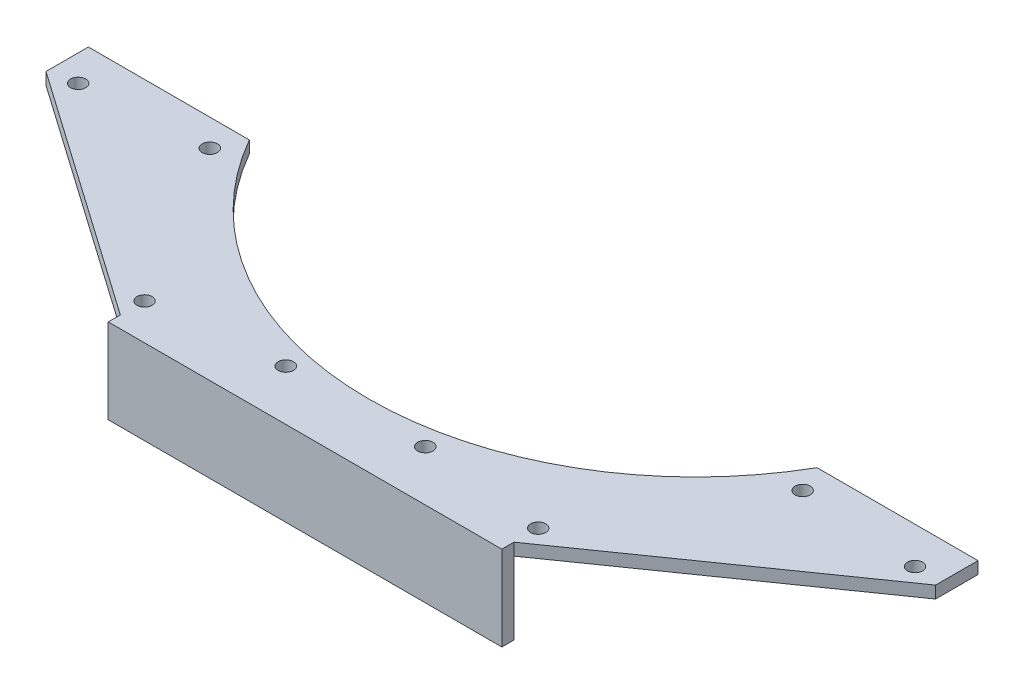
ISO-10303-21;
HEADER;
FILE_DESCRIPTION(('STEP AP214'),'2;1');
FILE_NAME('part.step','',(''),(''),'','','');
FILE_SCHEMA(('AUTOMOTIVE_DESIGN { 1 0 10303 214 1 1 1 1 }'));
ENDSEC;
DATA;
#1=APPLICATION_CONTEXT('core data for automotive mechanical design processes');
#2=APPLICATION_PROTOCOL_DEFINITION('international standard','automotive_design',2000,#1);
#3=PRODUCT_CONTEXT('',#1,'mechanical');
#4=PRODUCT('Part','Part','',(#3));
#5=PRODUCT_RELATED_PRODUCT_CATEGORY('part','',(#4));
#6=PRODUCT_DEFINITION_FORMATION('','',#4);
#7=PRODUCT_DEFINITION_CONTEXT('part definition',#1,'design');
#8=PRODUCT_DEFINITION('design','',#6,#7);
#9=PRODUCT_DEFINITION_SHAPE('','',#8);
#10=(LENGTH_UNIT() NAMED_UNIT(*) SI_UNIT(.MILLI.,.METRE.));
#11=(NAMED_UNIT(*) PLANE_ANGLE_UNIT() SI_UNIT($,.RADIAN.));
#12=(NAMED_UNIT(*) SI_UNIT($,.STERADIAN.) SOLID_ANGLE_UNIT());
#13=UNCERTAINTY_MEASURE_WITH_UNIT(LENGTH_MEASURE(1.E-05),#10,'distance_accuracy_value','');
#14=(GEOMETRIC_REPRESENTATION_CONTEXT(3) GLOBAL_UNCERTAINTY_ASSIGNED_CONTEXT((#13)) GLOBAL_UNIT_ASSIGNED_CONTEXT((#10,
#11,#12)) REPRESENTATION_CONTEXT('',''));
#15=CARTESIAN_POINT('',(0.,0.,0.));
#16=DIRECTION('',(0.,0.,1.));
#17=DIRECTION('',(1.,0.,0.));
#18=AXIS2_PLACEMENT_3D('',#15,#16,#17);
#19=CARTESIAN_POINT('',(-79.4956728564102,12.9202008414319,32.3909436641696));
#20=DIRECTION('',(0.,1.,0.));
#21=DIRECTION('',(0.,0.,1.));
#22=AXIS2_PLACEMENT_3D('',#19,#20,#21);
#23=PLANE('',#22);
#24=CARTESIAN_POINT('',(-38.2206728564096,12.9202008414319,106.669766716582));
#25=DIRECTION('',(0.,1.,0.));
#26=DIRECTION('',(0.,0.,-1.));
#27=AXIS2_PLACEMENT_3D('',#24,#25,#26);
#28=CIRCLE('',#27,1.58749999999999);
#29=CARTESIAN_POINT('',(-38.2206728564096,12.9202008414319,105.082266716582));
#30=VERTEX_POINT('',#29);
#31=EDGE_CURVE('E175',#30,#30,#28,.T.);
#32=ORIENTED_EDGE('',*,*,#31,.F.);
#33=EDGE_LOOP('',(#32));
#34=FACE_BOUND('',#33,.T.);
#35=CARTESIAN_POINT('',(-120.77067285641,12.9202008414319,106.669766716582));
#36=DIRECTION('',(0.,1.,0.));
#37=DIRECTION('',(0.,0.,1.));
#38=AXIS2_PLACEMENT_3D('',#35,#36,#37);
#39=CIRCLE('',#38,1.58749999999999);
#40=CARTESIAN_POINT('',(-120.77067285641,12.9202008414319,108.257266716582));
#41=VERTEX_POINT('',#40);
#42=EDGE_CURVE('E191',#41,#41,#39,.T.);
#43=ORIENTED_EDGE('',*,*,#42,.F.);
#44=EDGE_LOOP('',(#43));
#45=FACE_BOUND('',#44,.T.);
#46=CARTESIAN_POINT('',(-94.1274470076194,12.9202008414319,103.699839694413));
#47=DIRECTION('',(0.,1.,0.));
#48=DIRECTION('',(0.,0.,1.));
#49=AXIS2_PLACEMENT_3D('',#46,#47,#48);
#50=CIRCLE('',#49,1.59999999999999);
#51=CARTESIAN_POINT('',(-94.1274470076194,12.9202008414319,105.299839694413));
#52=VERTEX_POINT('',#51);
#53=EDGE_CURVE('E207',#52,#52,#50,.T.);
#54=ORIENTED_EDGE('',*,*,#53,.F.);
#55=EDGE_LOOP('',(#54));
#56=FACE_BOUND('',#55,.T.);
#57=CARTESIAN_POINT('',(-17.3270953788913,12.9202008414319,72.0941077215056));
#58=DIRECTION('',(0.,1.,0.));
#59=DIRECTION('',(0.,0.,1.));
#60=AXIS2_PLACEMENT_3D('',#57,#58,#59);
#61=CIRCLE('',#60,1.59999999999899);
#62=CARTESIAN_POINT('',(-17.3270953788913,12.9202008414319,73.6941077215046));
#63=VERTEX_POINT('',#62);
#64=EDGE_CURVE('E223',#63,#63,#61,.T.);
#65=ORIENTED_EDGE('',*,*,#64,.F.);
#66=EDGE_LOOP('',(#65));
#67=FACE_BOUND('',#66,.T.);
#68=DIRECTION('',(0.,0.,-1.));
#69=VECTOR('',#68,1.);
#70=CARTESIAN_POINT('',(13.7954819559413,12.9202008414319,75.32766300829));
#71=LINE('',#70,#69);
#72=CARTESIAN_POINT('',(13.7954819559413,12.9202008414319,75.32766300829));
#73=VERTEX_POINT('',#72);
#74=CARTESIAN_POINT('',(13.7954819559413,12.9202008414319,66.43766300829));
#75=VERTEX_POINT('',#74);
#76=EDGE_CURVE('E231',#73,#75,#71,.T.);
#77=ORIENTED_EDGE('',*,*,#76,.T.);
#78=DIRECTION('',(-1.,0.,0.));
#79=VECTOR('',#78,1.);
#80=CARTESIAN_POINT('',(-19.9638552972033,12.9202008414319,66.43766300829));
#81=LINE('',#80,#79);
#82=CARTESIAN_POINT('',(-19.9638552972033,12.9202008414319,66.4376630082901));
#83=VERTEX_POINT('',#82);
#84=EDGE_CURVE('E103',#75,#83,#81,.T.);
#85=ORIENTED_EDGE('',*,*,#84,.T.);
#86=CARTESIAN_POINT('',(-79.4956728564102,12.9202008414319,32.3909436641696));
#87=DIRECTION('',(0.,-1.,0.));
#88=DIRECTION('',(0.,0.,1.));
#89=AXIS2_PLACEMENT_3D('',#86,#87,#88);
#90=CIRCLE('',#89,68.58);
#91=CARTESIAN_POINT('',(-139.027490415617,12.9202008414319,66.43766300829));
#92=VERTEX_POINT('',#91);
#93=EDGE_CURVE('E236',#83,#92,#90,.T.);
#94=ORIENTED_EDGE('',*,*,#93,.T.);
#95=DIRECTION('',(-1.,0.,0.));
#96=VECTOR('',#95,1.);
#97=CARTESIAN_POINT('',(-172.786827668761,12.9202008414319,66.43766300829));
#98=LINE('',#97,#96);
#99=CARTESIAN_POINT('',(-172.786827668761,12.9202008414319,66.43766300829));
#100=VERTEX_POINT('',#99);
#101=EDGE_CURVE('E239',#92,#100,#98,.T.);
#102=ORIENTED_EDGE('',*,*,#101,.T.);
#103=DIRECTION('',(0.,0.,1.));
#104=VECTOR('',#103,1.);
#105=CARTESIAN_POINT('',(-172.786827668761,12.9202008414319,75.32766300829));
#106=LINE('',#105,#104);
#107=CARTESIAN_POINT('',(-172.786827668761,12.9202008414319,75.32766300829));
#108=VERTEX_POINT('',#107);
#109=EDGE_CURVE('E127',#100,#108,#106,.T.);
#110=ORIENTED_EDGE('',*,*,#109,.T.);
#111=DIRECTION('',(0.819152044288991,0.,0.573576436351047));
#112=VECTOR('',#111,1.);
#113=CARTESIAN_POINT('',(-120.77067285641,12.9202008414319,111.749766716582));
#114=LINE('',#113,#112);
#115=CARTESIAN_POINT('',(-120.77067285641,12.9202008414319,111.749766716582));
#116=VERTEX_POINT('',#115);
#117=EDGE_CURVE('E119',#108,#116,#114,.T.);
#118=ORIENTED_EDGE('',*,*,#117,.T.);
#119=DIRECTION('',(0.,0.,-1.));
#120=VECTOR('',#119,1.);
#121=CARTESIAN_POINT('',(-120.77067285641,12.9202008414319,114.289766716582));
#122=LINE('',#121,#120);
#123=CARTESIAN_POINT('',(-120.77067285641,12.9202008414319,114.289766716582));
#124=VERTEX_POINT('',#123);
#125=EDGE_CURVE('E124',#124,#116,#122,.T.);
#126=ORIENTED_EDGE('',*,*,#125,.F.);
#127=DIRECTION('',(-1.,0.,0.));
#128=VECTOR('',#127,1.);
#129=CARTESIAN_POINT('',(-120.77067285641,12.9202008414319,114.289766716582));
#130=LINE('',#129,#128);
#131=CARTESIAN_POINT('',(-38.2206728564096,12.9202008414319,114.289766716582));
#132=VERTEX_POINT('',#131);
#133=EDGE_CURVE('E146',#132,#124,#130,.T.);
#134=ORIENTED_EDGE('',*,*,#133,.F.);
#135=DIRECTION('',(0.,0.,-1.));
#136=VECTOR('',#135,1.);
#137=CARTESIAN_POINT('',(-38.2206728564096,12.9202008414319,114.289766716582));
#138=LINE('',#137,#136);
#139=CARTESIAN_POINT('',(-38.2206728564096,12.9202008414319,111.749766716582));
#140=VERTEX_POINT('',#139);
#141=EDGE_CURVE('E145',#132,#140,#138,.T.);
#142=ORIENTED_EDGE('',*,*,#141,.T.);
#143=DIRECTION('',(0.819152044288991,0.,-0.573576436351047));
#144=VECTOR('',#143,1.);
#145=CARTESIAN_POINT('',(-38.2206728564096,12.9202008414319,111.749766716582));
#146=LINE('',#145,#144);
#147=EDGE_CURVE('E61',#140,#73,#146,.T.);
#148=ORIENTED_EDGE('',*,*,#147,.T.);
#149=EDGE_LOOP('',(#77,#85,#94,#102,#110,#118,#126,#134,#142,#148));
#150=FACE_BOUND('',#149,.T.);
#151=CARTESIAN_POINT('',(-141.664250333928,12.9202008414319,72.0941077215066));
#152=DIRECTION('',(0.,1.,0.));
#153=DIRECTION('',(0.,0.,1.));
#154=AXIS2_PLACEMENT_3D('',#151,#152,#153);
#155=CIRCLE('',#154,1.599999999999);
#156=CARTESIAN_POINT('',(-141.664250333928,12.9202008414319,73.6941077215056));
#157=VERTEX_POINT('',#156);
#158=EDGE_CURVE('E215',#157,#157,#155,.T.);
#159=ORIENTED_EDGE('',*,*,#158,.F.);
#160=EDGE_LOOP('',(#159));
#161=FACE_BOUND('',#160,.T.);
#162=CARTESIAN_POINT('',(-64.8638987052,12.9202008414319,103.699839694412));
#163=DIRECTION('',(0.,1.,0.));
#164=DIRECTION('',(0.,0.,1.));
#165=AXIS2_PLACEMENT_3D('',#162,#163,#164);
#166=CIRCLE('',#165,1.59999999999999);
#167=CARTESIAN_POINT('',(-64.8638987052,12.9202008414319,105.299839694412));
#168=VERTEX_POINT('',#167);
#169=EDGE_CURVE('E199',#168,#168,#166,.T.);
#170=ORIENTED_EDGE('',*,*,#169,.F.);
#171=EDGE_LOOP('',(#170));
#172=FACE_BOUND('',#171,.T.);
#173=CARTESIAN_POINT('',(8.2651098980342,12.9202008414319,74.120071212341));
#174=DIRECTION('',(0.,1.,0.));
#175=DIRECTION('',(0.,0.,-1.));
#176=AXIS2_PLACEMENT_3D('',#173,#174,#175);
#177=CIRCLE('',#176,1.58749999999999);
#178=CARTESIAN_POINT('',(8.2651098980342,12.9202008414319,72.532571212341));
#179=VERTEX_POINT('',#178);
#180=EDGE_CURVE('E183',#179,#179,#177,.T.);
#181=ORIENTED_EDGE('',*,*,#180,.F.);
#182=EDGE_LOOP('',(#181));
#183=FACE_BOUND('',#182,.T.);
#184=CARTESIAN_POINT('',(-167.256455610853,12.9202008414319,74.120071212341));
#185=DIRECTION('',(0.,1.,0.));
#186=DIRECTION('',(0.,0.,1.));
#187=AXIS2_PLACEMENT_3D('',#184,#185,#186);
#188=CIRCLE('',#187,1.58749999999999);
#189=CARTESIAN_POINT('',(-167.256455610853,12.9202008414319,75.707571212341));
#190=VERTEX_POINT('',#189);
#191=EDGE_CURVE('E167',#190,#190,#188,.T.);
#192=ORIENTED_EDGE('',*,*,#191,.F.);
#193=EDGE_LOOP('',(#192));
#194=FACE_BOUND('',#193,.T.);
#195=ADVANCED_FACE('F43',(#34,#45,#56,#67,#150,#161,#172,#183,#194),#23,.T.);
#196=CARTESIAN_POINT('',(-79.4956728564102,10.3802008414319,32.3909436641696));
#197=DIRECTION('',(0.,1.,0.));
#198=DIRECTION('',(0.,0.,1.));
#199=AXIS2_PLACEMENT_3D('',#196,#197,#198);
#200=PLANE('',#199);
#201=DIRECTION('',(0.,0.,-1.));
#202=VECTOR('',#201,1.);
#203=CARTESIAN_POINT('',(13.7954819559413,10.3802008414319,75.32766300829));
#204=LINE('',#203,#202);
#205=CARTESIAN_POINT('',(13.7954819559413,10.3802008414319,75.32766300829));
#206=VERTEX_POINT('',#205);
#207=CARTESIAN_POINT('',(13.7954819559413,10.3802008414319,66.43766300829));
#208=VERTEX_POINT('',#207);
#209=EDGE_CURVE('E227',#206,#208,#204,.T.);
#210=ORIENTED_EDGE('',*,*,#209,.F.);
#211=DIRECTION('',(0.819152044288991,0.,-0.573576436351047));
#212=VECTOR('',#211,1.);
#213=CARTESIAN_POINT('',(-38.2206728564096,10.3802008414319,111.749766716582));
#214=LINE('',#213,#212);
#215=CARTESIAN_POINT('',(-38.2206728564096,10.3802008414319,111.749766716582));
#216=VERTEX_POINT('',#215);
#217=EDGE_CURVE('E95',#216,#206,#214,.T.);
#218=ORIENTED_EDGE('',*,*,#217,.F.);
#219=DIRECTION('',(1.,0.,0.));
#220=VECTOR('',#219,1.);
#221=CARTESIAN_POINT('',(-38.2206728564096,10.3802008414319,111.749766716582));
#222=LINE('',#221,#220);
#223=CARTESIAN_POINT('',(-120.77067285641,10.3802008414319,111.749766716582));
#224=VERTEX_POINT('',#223);
#225=EDGE_CURVE('E264',#224,#216,#222,.T.);
#226=ORIENTED_EDGE('',*,*,#225,.F.);
#227=DIRECTION('',(0.819152044288991,0.,0.573576436351047));
#228=VECTOR('',#227,1.);
#229=CARTESIAN_POINT('',(-120.77067285641,10.3802008414319,111.749766716582));
#230=LINE('',#229,#228);
#231=CARTESIAN_POINT('',(-172.786827668761,10.3802008414319,75.32766300829));
#232=VERTEX_POINT('',#231);
#233=EDGE_CURVE('E88',#232,#224,#230,.T.);
#234=ORIENTED_EDGE('',*,*,#233,.F.);
#235=DIRECTION('',(0.,0.,1.));
#236=VECTOR('',#235,1.);
#237=CARTESIAN_POINT('',(-172.786827668761,10.3802008414319,75.32766300829));
#238=LINE('',#237,#236);
#239=CARTESIAN_POINT('',(-172.786827668761,10.3802008414319,66.43766300829));
#240=VERTEX_POINT('',#239);
#241=EDGE_CURVE('E259',#240,#232,#238,.T.);
#242=ORIENTED_EDGE('',*,*,#241,.F.);
#243=DIRECTION('',(-1.,0.,0.));
#244=VECTOR('',#243,1.);
#245=CARTESIAN_POINT('',(-172.786827668761,10.3802008414319,66.43766300829));
#246=LINE('',#245,#244);
#247=CARTESIAN_POINT('',(-139.027490415617,10.3802008414319,66.43766300829));
#248=VERTEX_POINT('',#247);
#249=EDGE_CURVE('E256',#248,#240,#246,.T.);
#250=ORIENTED_EDGE('',*,*,#249,.F.);
#251=CARTESIAN_POINT('',(-79.4956728564102,10.3802008414319,32.3909436641696));
#252=DIRECTION('',(0.,-1.,0.));
#253=DIRECTION('',(0.,0.,1.));
#254=AXIS2_PLACEMENT_3D('',#251,#252,#253);
#255=CIRCLE('',#254,68.58);
#256=CARTESIAN_POINT('',(-19.9638552972033,10.3802008414319,66.4376630082901));
#257=VERTEX_POINT('',#256);
#258=EDGE_CURVE('E253',#257,#248,#255,.T.);
#259=ORIENTED_EDGE('',*,*,#258,.F.);
#260=DIRECTION('',(-1.,0.,0.));
#261=VECTOR('',#260,1.);
#262=CARTESIAN_POINT('',(-19.9638552972033,10.3802008414319,66.43766300829));
#263=LINE('',#262,#261);
#264=EDGE_CURVE('E250',#208,#257,#263,.T.);
#265=ORIENTED_EDGE('',*,*,#264,.F.);
#266=EDGE_LOOP('',(#210,#218,#226,#234,#242,#250,#259,#265));
#267=FACE_BOUND('',#266,.T.);
#268=CARTESIAN_POINT('',(-17.3270953788913,10.3802008414319,72.0941077215056));
#269=DIRECTION('',(0.,1.,0.));
#270=DIRECTION('',(0.,0.,1.));
#271=AXIS2_PLACEMENT_3D('',#268,#269,#270);
#272=CIRCLE('',#271,1.59999999999899);
#273=CARTESIAN_POINT('',(-17.3270953788913,10.3802008414319,73.6941077215046));
#274=VERTEX_POINT('',#273);
#275=EDGE_CURVE('E219',#274,#274,#272,.T.);
#276=ORIENTED_EDGE('',*,*,#275,.T.);
#277=EDGE_LOOP('',(#276));
#278=FACE_BOUND('',#277,.T.);
#279=CARTESIAN_POINT('',(-141.664250333928,10.3802008414319,72.0941077215066));
#280=DIRECTION('',(0.,1.,0.));
#281=DIRECTION('',(0.,0.,1.));
#282=AXIS2_PLACEMENT_3D('',#279,#280,#281);
#283=CIRCLE('',#282,1.599999999999);
#284=CARTESIAN_POINT('',(-141.664250333928,10.3802008414319,73.6941077215056));
#285=VERTEX_POINT('',#284);
#286=EDGE_CURVE('E211',#285,#285,#283,.T.);
#287=ORIENTED_EDGE('',*,*,#286,.T.);
#288=EDGE_LOOP('',(#287));
#289=FACE_BOUND('',#288,.T.);
#290=CARTESIAN_POINT('',(-94.1274470076194,10.3802008414319,103.699839694413));
#291=DIRECTION('',(0.,1.,0.));
#292=DIRECTION('',(0.,0.,1.));
#293=AXIS2_PLACEMENT_3D('',#290,#291,#292);
#294=CIRCLE('',#293,1.59999999999999);
#295=CARTESIAN_POINT('',(-94.1274470076194,10.3802008414319,105.299839694413));
#296=VERTEX_POINT('',#295);
#297=EDGE_CURVE('E203',#296,#296,#294,.T.);
#298=ORIENTED_EDGE('',*,*,#297,.T.);
#299=EDGE_LOOP('',(#298));
#300=FACE_BOUND('',#299,.T.);
#301=CARTESIAN_POINT('',(-64.8638987052,10.3802008414319,103.699839694412));
#302=DIRECTION('',(0.,1.,0.));
#303=DIRECTION('',(0.,0.,1.));
#304=AXIS2_PLACEMENT_3D('',#301,#302,#303);
#305=CIRCLE('',#304,1.59999999999999);
#306=CARTESIAN_POINT('',(-64.8638987052,10.3802008414319,105.299839694412));
#307=VERTEX_POINT('',#306);
#308=EDGE_CURVE('E195',#307,#307,#305,.T.);
#309=ORIENTED_EDGE('',*,*,#308,.T.);
#310=EDGE_LOOP('',(#309));
#311=FACE_BOUND('',#310,.T.);
#312=CARTESIAN_POINT('',(-120.77067285641,10.3802008414319,106.669766716582));
#313=DIRECTION('',(0.,1.,0.));
#314=DIRECTION('',(0.,0.,1.));
#315=AXIS2_PLACEMENT_3D('',#312,#313,#314);
#316=CIRCLE('',#315,1.58749999999999);
#317=CARTESIAN_POINT('',(-120.77067285641,10.3802008414319,108.257266716582));
#318=VERTEX_POINT('',#317);
#319=EDGE_CURVE('E187',#318,#318,#316,.T.);
#320=ORIENTED_EDGE('',*,*,#319,.T.);
#321=EDGE_LOOP('',(#320));
#322=FACE_BOUND('',#321,.T.);
#323=CARTESIAN_POINT('',(8.2651098980342,10.3802008414319,74.120071212341));
#324=DIRECTION('',(0.,1.,0.));
#325=DIRECTION('',(0.,0.,-1.));
#326=AXIS2_PLACEMENT_3D('',#323,#324,#325);
#327=CIRCLE('',#326,1.58749999999999);
#328=CARTESIAN_POINT('',(8.2651098980342,10.3802008414319,72.532571212341));
#329=VERTEX_POINT('',#328);
#330=EDGE_CURVE('E179',#329,#329,#327,.T.);
#331=ORIENTED_EDGE('',*,*,#330,.T.);
#332=EDGE_LOOP('',(#331));
#333=FACE_BOUND('',#332,.T.);
#334=CARTESIAN_POINT('',(-38.2206728564096,10.3802008414319,106.669766716582));
#335=DIRECTION('',(0.,1.,0.));
#336=DIRECTION('',(0.,0.,-1.));
#337=AXIS2_PLACEMENT_3D('',#334,#335,#336);
#338=CIRCLE('',#337,1.58749999999999);
#339=CARTESIAN_POINT('',(-38.2206728564096,10.3802008414319,105.082266716582));
#340=VERTEX_POINT('',#339);
#341=EDGE_CURVE('E171',#340,#340,#338,.T.);
#342=ORIENTED_EDGE('',*,*,#341,.T.);
#343=EDGE_LOOP('',(#342));
#344=FACE_BOUND('',#343,.T.);
#345=CARTESIAN_POINT('',(-167.256455610853,10.3802008414319,74.120071212341));
#346=DIRECTION('',(0.,1.,0.));
#347=DIRECTION('',(0.,0.,1.));
#348=AXIS2_PLACEMENT_3D('',#345,#346,#347);
#349=CIRCLE('',#348,1.58749999999999);
#350=CARTESIAN_POINT('',(-167.256455610853,10.3802008414319,75.707571212341));
#351=VERTEX_POINT('',#350);
#352=EDGE_CURVE('E166',#351,#351,#349,.T.);
#353=ORIENTED_EDGE('',*,*,#352,.T.);
#354=EDGE_LOOP('',(#353));
#355=FACE_BOUND('',#354,.T.);
#356=ADVANCED_FACE('F293',(#267,#278,#289,#300,#311,#322,#333,#344,#355),#200,.F.);
#357=CARTESIAN_POINT('',(13.7954819559413,12.9202008414319,75.32766300829));
#358=DIRECTION('',(-1.,0.,0.));
#359=DIRECTION('',(0.,0.,1.));
#360=AXIS2_PLACEMENT_3D('',#357,#358,#359);
#361=PLANE('',#360);
#362=ORIENTED_EDGE('',*,*,#209,.T.);
#363=DIRECTION('',(0.,-1.,0.));
#364=VECTOR('',#363,1.);
#365=CARTESIAN_POINT('',(13.7954819559413,12.9202008414319,66.43766300829));
#366=LINE('',#365,#364);
#367=EDGE_CURVE('E11',#75,#208,#366,.T.);
#368=ORIENTED_EDGE('',*,*,#367,.F.);
#369=ORIENTED_EDGE('',*,*,#76,.F.);
#370=DIRECTION('',(0.,-1.,0.));
#371=VECTOR('',#370,1.);
#372=CARTESIAN_POINT('',(13.7954819559413,12.9202008414319,75.32766300829));
#373=LINE('',#372,#371);
#374=EDGE_CURVE('E246',#73,#206,#373,.T.);
#375=ORIENTED_EDGE('',*,*,#374,.T.);
#376=EDGE_LOOP('',(#362,#368,#369,#375));
#377=FACE_BOUND('',#376,.T.);
#378=ADVANCED_FACE('F45',(#377),#361,.F.);
#379=CARTESIAN_POINT('',(-19.9638552972033,12.9202008414319,66.43766300829));
#380=DIRECTION('',(0.,0.,1.));
#381=DIRECTION('',(1.,0.,0.));
#382=AXIS2_PLACEMENT_3D('',#379,#380,#381);
#383=PLANE('',#382);
#384=ORIENTED_EDGE('',*,*,#264,.T.);
#385=DIRECTION('',(0.,-1.,0.));
#386=VECTOR('',#385,1.);
#387=CARTESIAN_POINT('',(-19.9638552972033,12.9202008414319,66.4376630082901));
#388=LINE('',#387,#386);
#389=EDGE_CURVE('E53',#83,#257,#388,.T.);
#390=ORIENTED_EDGE('',*,*,#389,.F.);
#391=ORIENTED_EDGE('',*,*,#84,.F.);
#392=ORIENTED_EDGE('',*,*,#367,.T.);
#393=EDGE_LOOP('',(#384,#390,#391,#392));
#394=FACE_BOUND('',#393,.T.);
#395=ADVANCED_FACE('F376',(#394),#383,.F.);
#396=CARTESIAN_POINT('',(-79.4956728564102,12.9202008414319,32.3909436641696));
#397=DIRECTION('',(0.,-1.,0.));
#398=DIRECTION('',(0.,0.,-1.));
#399=AXIS2_PLACEMENT_3D('',#396,#397,#398);
#400=CYLINDRICAL_SURFACE('',#399,68.58);
#401=ORIENTED_EDGE('',*,*,#258,.T.);
#402=DIRECTION('',(0.,-1.,0.));
#403=VECTOR('',#402,1.);
#404=CARTESIAN_POINT('',(-139.027490415617,12.9202008414319,66.43766300829));
#405=LINE('',#404,#403);
#406=EDGE_CURVE('E280',#92,#248,#405,.T.);
#407=ORIENTED_EDGE('',*,*,#406,.F.);
#408=ORIENTED_EDGE('',*,*,#93,.F.);
#409=ORIENTED_EDGE('',*,*,#389,.T.);
#410=EDGE_LOOP('',(#401,#407,#408,#409));
#411=FACE_BOUND('',#410,.T.);
#412=ADVANCED_FACE('F288',(#411),#400,.F.);
#413=CARTESIAN_POINT('',(-172.786827668761,12.9202008414319,66.43766300829));
#414=DIRECTION('',(0.,0.,1.));
#415=DIRECTION('',(1.,0.,0.));
#416=AXIS2_PLACEMENT_3D('',#413,#414,#415);
#417=PLANE('',#416);
#418=ORIENTED_EDGE('',*,*,#249,.T.);
#419=DIRECTION('',(0.,-1.,0.));
#420=VECTOR('',#419,1.);
#421=CARTESIAN_POINT('',(-172.786827668761,12.9202008414319,66.43766300829));
#422=LINE('',#421,#420);
#423=EDGE_CURVE('E276',#100,#240,#422,.T.);
#424=ORIENTED_EDGE('',*,*,#423,.F.);
#425=ORIENTED_EDGE('',*,*,#101,.F.);
#426=ORIENTED_EDGE('',*,*,#406,.T.);
#427=EDGE_LOOP('',(#418,#424,#425,#426));
#428=FACE_BOUND('',#427,.T.);
#429=ADVANCED_FACE('F298',(#428),#417,.F.);
#430=CARTESIAN_POINT('',(-172.786827668761,12.9202008414319,75.32766300829));
#431=DIRECTION('',(1.,0.,0.));
#432=DIRECTION('',(0.,0.,-1.));
#433=AXIS2_PLACEMENT_3D('',#430,#431,#432);
#434=PLANE('',#433);
#435=ORIENTED_EDGE('',*,*,#241,.T.);
#436=DIRECTION('',(0.,-1.,0.));
#437=VECTOR('',#436,1.);
#438=CARTESIAN_POINT('',(-172.786827668761,12.9202008414319,75.32766300829));
#439=LINE('',#438,#437);
#440=EDGE_CURVE('E137',#108,#232,#439,.T.);
#441=ORIENTED_EDGE('',*,*,#440,.F.);
#442=ORIENTED_EDGE('',*,*,#109,.F.);
#443=ORIENTED_EDGE('',*,*,#423,.T.);
#444=EDGE_LOOP('',(#435,#441,#442,#443));
#445=FACE_BOUND('',#444,.T.);
#446=ADVANCED_FACE('F301',(#445),#434,.F.);
#447=CARTESIAN_POINT('',(-120.77067285641,12.9202008414319,111.749766716582));
#448=DIRECTION('',(0.573576436351047,0.,-0.819152044288991));
#449=DIRECTION('',(-0.819152044288991,0.,-0.573576436351047));
#450=AXIS2_PLACEMENT_3D('',#447,#448,#449);
#451=PLANE('',#450);
#452=ORIENTED_EDGE('',*,*,#233,.T.);
#453=DIRECTION('',(0.,-1.,0.));
#454=VECTOR('',#453,1.);
#455=CARTESIAN_POINT('',(-120.77067285641,12.9202008414319,111.749766716582));
#456=LINE('',#455,#454);
#457=EDGE_CURVE('E132',#116,#224,#456,.T.);
#458=ORIENTED_EDGE('',*,*,#457,.F.);
#459=ORIENTED_EDGE('',*,*,#117,.F.);
#460=ORIENTED_EDGE('',*,*,#440,.T.);
#461=EDGE_LOOP('',(#452,#458,#459,#460));
#462=FACE_BOUND('',#461,.T.);
#463=ADVANCED_FACE('F133',(#462),#451,.F.);
#464=CARTESIAN_POINT('',(-38.2206728564096,12.9202008414319,111.749766716582));
#465=DIRECTION('',(-0.573576436351047,0.,-0.819152044288991));
#466=DIRECTION('',(-0.819152044288991,0.,0.573576436351047));
#467=AXIS2_PLACEMENT_3D('',#464,#465,#466);
#468=PLANE('',#467);
#469=ORIENTED_EDGE('',*,*,#217,.T.);
#470=ORIENTED_EDGE('',*,*,#374,.F.);
#471=ORIENTED_EDGE('',*,*,#147,.F.);
#472=DIRECTION('',(0.,-1.,0.));
#473=VECTOR('',#472,1.);
#474=CARTESIAN_POINT('',(-38.2206728564096,12.9202008414319,111.749766716582));
#475=LINE('',#474,#473);
#476=EDGE_CURVE('E138',#140,#216,#475,.T.);
#477=ORIENTED_EDGE('',*,*,#476,.T.);
#478=EDGE_LOOP('',(#469,#470,#471,#477));
#479=FACE_BOUND('',#478,.T.);
#480=ADVANCED_FACE('F366',(#479),#468,.F.);
#481=CARTESIAN_POINT('',(-17.3270953788913,12.9202008414319,72.0941077215056));
#482=DIRECTION('',(0.,-1.,0.));
#483=DIRECTION('',(0.,0.,-1.));
#484=AXIS2_PLACEMENT_3D('',#481,#482,#483);
#485=CYLINDRICAL_SURFACE('',#484,1.59999999999899);
#486=ORIENTED_EDGE('',*,*,#64,.T.);
#487=EDGE_LOOP('',(#486));
#488=FACE_BOUND('',#487,.T.);
#489=ORIENTED_EDGE('',*,*,#275,.F.);
#490=EDGE_LOOP('',(#489));
#491=FACE_BOUND('',#490,.T.);
#492=ADVANCED_FACE('F363',(#488,#491),#485,.F.);
#493=CARTESIAN_POINT('',(-141.664250333928,12.9202008414319,72.0941077215066));
#494=DIRECTION('',(0.,-1.,0.));
#495=DIRECTION('',(0.,0.,-1.));
#496=AXIS2_PLACEMENT_3D('',#493,#494,#495);
#497=CYLINDRICAL_SURFACE('',#496,1.599999999999);
#498=ORIENTED_EDGE('',*,*,#158,.T.);
#499=EDGE_LOOP('',(#498));
#500=FACE_BOUND('',#499,.T.);
#501=ORIENTED_EDGE('',*,*,#286,.F.);
#502=EDGE_LOOP('',(#501));
#503=FACE_BOUND('',#502,.T.);
#504=ADVANCED_FACE('F513',(#500,#503),#497,.F.);
#505=CARTESIAN_POINT('',(-94.1274470076194,12.9202008414319,103.699839694413));
#506=DIRECTION('',(0.,-1.,0.));
#507=DIRECTION('',(0.,0.,-1.));
#508=AXIS2_PLACEMENT_3D('',#505,#506,#507);
#509=CYLINDRICAL_SURFACE('',#508,1.59999999999999);
#510=ORIENTED_EDGE('',*,*,#53,.T.);
#511=EDGE_LOOP('',(#510));
#512=FACE_BOUND('',#511,.T.);
#513=ORIENTED_EDGE('',*,*,#297,.F.);
#514=EDGE_LOOP('',(#513));
#515=FACE_BOUND('',#514,.T.);
#516=ADVANCED_FACE('F503',(#512,#515),#509,.F.);
#517=CARTESIAN_POINT('',(-64.8638987052,12.9202008414319,103.699839694412));
#518=DIRECTION('',(0.,-1.,0.));
#519=DIRECTION('',(0.,0.,-1.));
#520=AXIS2_PLACEMENT_3D('',#517,#518,#519);
#521=CYLINDRICAL_SURFACE('',#520,1.59999999999999);
#522=ORIENTED_EDGE('',*,*,#169,.T.);
#523=EDGE_LOOP('',(#522));
#524=FACE_BOUND('',#523,.T.);
#525=ORIENTED_EDGE('',*,*,#308,.F.);
#526=EDGE_LOOP('',(#525));
#527=FACE_BOUND('',#526,.T.);
#528=ADVANCED_FACE('F493',(#524,#527),#521,.F.);
#529=CARTESIAN_POINT('',(-120.77067285641,12.9202008414319,106.669766716582));
#530=DIRECTION('',(0.,-1.,0.));
#531=DIRECTION('',(0.,0.,-1.));
#532=AXIS2_PLACEMENT_3D('',#529,#530,#531);
#533=CYLINDRICAL_SURFACE('',#532,1.58749999999999);
#534=ORIENTED_EDGE('',*,*,#42,.T.);
#535=EDGE_LOOP('',(#534));
#536=FACE_BOUND('',#535,.T.);
#537=ORIENTED_EDGE('',*,*,#319,.F.);
#538=EDGE_LOOP('',(#537));
#539=FACE_BOUND('',#538,.T.);
#540=ADVANCED_FACE('F483',(#536,#539),#533,.F.);
#541=CARTESIAN_POINT('',(8.2651098980342,12.9202008414319,74.120071212341));
#542=DIRECTION('',(0.,-1.,0.));
#543=DIRECTION('',(0.,0.,-1.));
#544=AXIS2_PLACEMENT_3D('',#541,#542,#543);
#545=CYLINDRICAL_SURFACE('',#544,1.58749999999999);
#546=ORIENTED_EDGE('',*,*,#180,.T.);
#547=EDGE_LOOP('',(#546));
#548=FACE_BOUND('',#547,.T.);
#549=ORIENTED_EDGE('',*,*,#330,.F.);
#550=EDGE_LOOP('',(#549));
#551=FACE_BOUND('',#550,.T.);
#552=ADVANCED_FACE('F473',(#548,#551),#545,.F.);
#553=CARTESIAN_POINT('',(-38.2206728564096,12.9202008414319,106.669766716582));
#554=DIRECTION('',(0.,-1.,0.));
#555=DIRECTION('',(0.,0.,-1.));
#556=AXIS2_PLACEMENT_3D('',#553,#554,#555);
#557=CYLINDRICAL_SURFACE('',#556,1.58749999999999);
#558=ORIENTED_EDGE('',*,*,#31,.T.);
#559=EDGE_LOOP('',(#558));
#560=FACE_BOUND('',#559,.T.);
#561=ORIENTED_EDGE('',*,*,#341,.F.);
#562=EDGE_LOOP('',(#561));
#563=FACE_BOUND('',#562,.T.);
#564=ADVANCED_FACE('F464',(#560,#563),#557,.F.);
#565=CARTESIAN_POINT('',(-167.256455610853,12.9202008414319,74.120071212341));
#566=DIRECTION('',(0.,-1.,0.));
#567=DIRECTION('',(0.,0.,-1.));
#568=AXIS2_PLACEMENT_3D('',#565,#566,#567);
#569=CYLINDRICAL_SURFACE('',#568,1.58749999999999);
#570=ORIENTED_EDGE('',*,*,#191,.T.);
#571=EDGE_LOOP('',(#570));
#572=FACE_BOUND('',#571,.T.);
#573=ORIENTED_EDGE('',*,*,#352,.F.);
#574=EDGE_LOOP('',(#573));
#575=FACE_BOUND('',#574,.T.);
#576=ADVANCED_FACE('F421',(#572,#575),#569,.F.);
#577=CARTESIAN_POINT('',(0.,0.,111.749766716582));
#578=DIRECTION('',(0.,0.,1.));
#579=DIRECTION('',(1.,0.,0.));
#580=AXIS2_PLACEMENT_3D('',#577,#578,#579);
#581=PLANE('',#580);
#582=DIRECTION('',(0.,-1.,0.));
#583=VECTOR('',#582,1.);
#584=CARTESIAN_POINT('',(-120.77067285641,12.9202008414319,111.749766716582));
#585=LINE('',#584,#583);
#586=CARTESIAN_POINT('',(-120.77067285641,-4.85979915856807,111.749766716582));
#587=VERTEX_POINT('',#586);
#588=EDGE_CURVE('E307',#224,#587,#585,.T.);
#589=ORIENTED_EDGE('',*,*,#588,.F.);
#590=ORIENTED_EDGE('',*,*,#225,.T.);
#591=DIRECTION('',(0.,1.,0.));
#592=VECTOR('',#591,1.);
#593=CARTESIAN_POINT('',(-38.2206728564096,12.9202008414319,111.749766716582));
#594=LINE('',#593,#592);
#595=CARTESIAN_POINT('',(-38.2206728564096,-4.85979915856807,111.749766716582));
#596=VERTEX_POINT('',#595);
#597=EDGE_CURVE('E156',#596,#216,#594,.T.);
#598=ORIENTED_EDGE('',*,*,#597,.F.);
#599=DIRECTION('',(1.,0.,0.));
#600=VECTOR('',#599,1.);
#601=CARTESIAN_POINT('',(-120.77067285641,-4.85979915856807,111.749766716582));
#602=LINE('',#601,#600);
#603=EDGE_CURVE('E311',#587,#596,#602,.T.);
#604=ORIENTED_EDGE('',*,*,#603,.F.);
#605=EDGE_LOOP('',(#589,#590,#598,#604));
#606=FACE_BOUND('',#605,.T.);
#607=ADVANCED_FACE('F308',(#606),#581,.F.);
#608=CARTESIAN_POINT('',(-120.77067285641,12.9202008414319,114.289766716582));
#609=DIRECTION('',(1.,0.,0.));
#610=DIRECTION('',(0.,0.,-1.));
#611=AXIS2_PLACEMENT_3D('',#608,#609,#610);
#612=PLANE('',#611);
#613=ORIENTED_EDGE('',*,*,#457,.T.);
#614=ORIENTED_EDGE('',*,*,#588,.T.);
#615=DIRECTION('',(0.,0.,-1.));
#616=VECTOR('',#615,1.);
#617=CARTESIAN_POINT('',(-120.77067285641,-4.85979915856807,114.289766716582));
#618=LINE('',#617,#616);
#619=CARTESIAN_POINT('',(-120.77067285641,-4.85979915856807,114.289766716582));
#620=VERTEX_POINT('',#619);
#621=EDGE_CURVE('E162',#620,#587,#618,.T.);
#622=ORIENTED_EDGE('',*,*,#621,.F.);
#623=DIRECTION('',(0.,-1.,0.));
#624=VECTOR('',#623,1.);
#625=CARTESIAN_POINT('',(-120.77067285641,12.9202008414319,114.289766716582));
#626=LINE('',#625,#624);
#627=EDGE_CURVE('E143',#124,#620,#626,.T.);
#628=ORIENTED_EDGE('',*,*,#627,.F.);
#629=ORIENTED_EDGE('',*,*,#125,.T.);
#630=EDGE_LOOP('',(#613,#614,#622,#628,#629));
#631=FACE_BOUND('',#630,.T.);
#632=ADVANCED_FACE('F140',(#631),#612,.F.);
#633=CARTESIAN_POINT('',(-120.77067285641,-4.85979915856807,114.289766716582));
#634=DIRECTION('',(0.,1.,0.));
#635=DIRECTION('',(0.,0.,1.));
#636=AXIS2_PLACEMENT_3D('',#633,#634,#635);
#637=PLANE('',#636);
#638=ORIENTED_EDGE('',*,*,#603,.T.);
#639=DIRECTION('',(0.,0.,-1.));
#640=VECTOR('',#639,1.);
#641=CARTESIAN_POINT('',(-38.2206728564096,-4.85979915856807,114.289766716582));
#642=LINE('',#641,#640);
#643=CARTESIAN_POINT('',(-38.2206728564096,-4.85979915856807,114.289766716582));
#644=VERTEX_POINT('',#643);
#645=EDGE_CURVE('E150',#644,#596,#642,.T.);
#646=ORIENTED_EDGE('',*,*,#645,.F.);
#647=DIRECTION('',(1.,0.,0.));
#648=VECTOR('',#647,1.);
#649=CARTESIAN_POINT('',(-120.77067285641,-4.85979915856807,114.289766716582));
#650=LINE('',#649,#648);
#651=EDGE_CURVE('E319',#620,#644,#650,.T.);
#652=ORIENTED_EDGE('',*,*,#651,.F.);
#653=ORIENTED_EDGE('',*,*,#621,.T.);
#654=EDGE_LOOP('',(#638,#646,#652,#653));
#655=FACE_BOUND('',#654,.T.);
#656=ADVANCED_FACE('F344',(#655),#637,.F.);
#657=CARTESIAN_POINT('',(-38.2206728564096,12.9202008414319,114.289766716582));
#658=DIRECTION('',(-1.,0.,0.));
#659=DIRECTION('',(0.,0.,1.));
#660=AXIS2_PLACEMENT_3D('',#657,#658,#659);
#661=PLANE('',#660);
#662=ORIENTED_EDGE('',*,*,#597,.T.);
#663=ORIENTED_EDGE('',*,*,#476,.F.);
#664=ORIENTED_EDGE('',*,*,#141,.F.);
#665=DIRECTION('',(0.,1.,0.));
#666=VECTOR('',#665,1.);
#667=CARTESIAN_POINT('',(-38.2206728564096,12.9202008414319,114.289766716582));
#668=LINE('',#667,#666);
#669=EDGE_CURVE('E153',#644,#132,#668,.T.);
#670=ORIENTED_EDGE('',*,*,#669,.F.);
#671=ORIENTED_EDGE('',*,*,#645,.T.);
#672=EDGE_LOOP('',(#662,#663,#664,#670,#671));
#673=FACE_BOUND('',#672,.T.);
#674=ADVANCED_FACE('F329',(#673),#661,.F.);
#675=CARTESIAN_POINT('',(0.,0.,114.289766716582));
#676=DIRECTION('',(0.,0.,1.));
#677=DIRECTION('',(1.,0.,0.));
#678=AXIS2_PLACEMENT_3D('',#675,#676,#677);
#679=PLANE('',#678);
#680=ORIENTED_EDGE('',*,*,#627,.T.);
#681=ORIENTED_EDGE('',*,*,#651,.T.);
#682=ORIENTED_EDGE('',*,*,#669,.T.);
#683=ORIENTED_EDGE('',*,*,#133,.T.);
#684=EDGE_LOOP('',(#680,#681,#682,#683));
#685=FACE_BOUND('',#684,.T.);
#686=ADVANCED_FACE('F343',(#685),#679,.T.);
#687=CLOSED_SHELL('',(#195,#356,#378,#395,#412,#429,#446,#463,#480,#492,#504,#516,#528,#540,
#552,#564,#576,#607,#632,#656,#674,#686));
#688=MANIFOLD_SOLID_BREP('B2',#687);
#689=ADVANCED_BREP_SHAPE_REPRESENTATION('',(#18,#688),#14);
#690=SHAPE_DEFINITION_REPRESENTATION(#9,#689);
ENDSEC;
END-ISO-10303-21;
